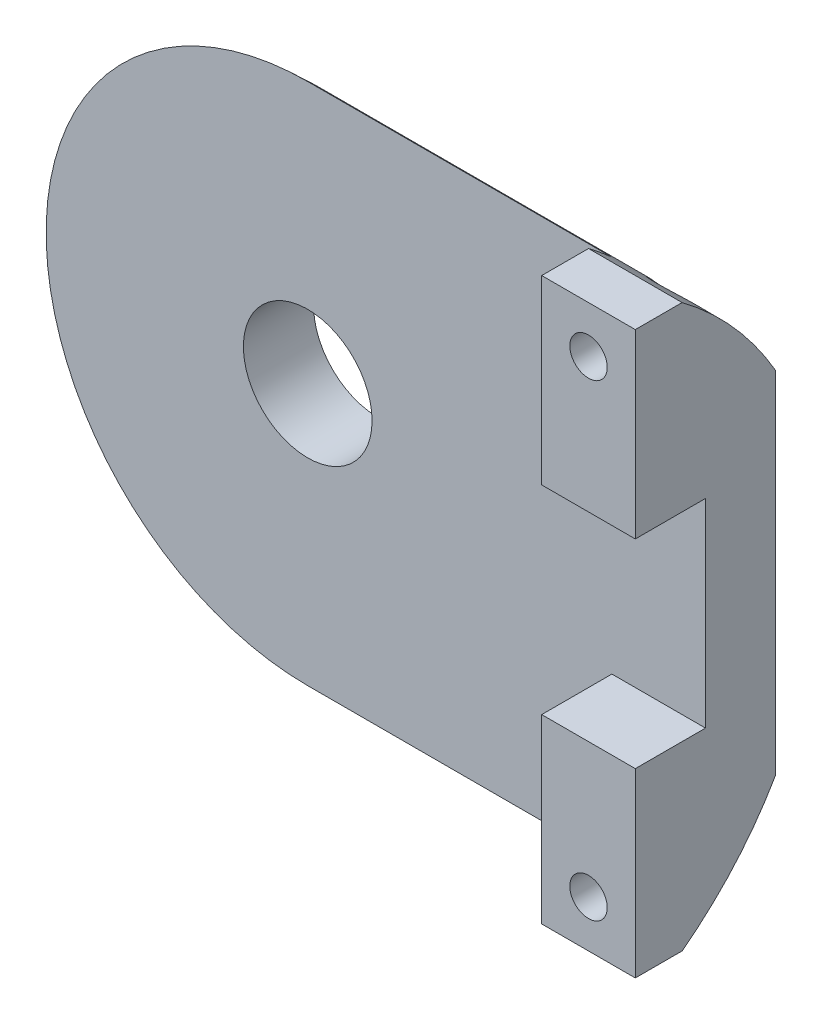
ISO-10303-21;
HEADER;
FILE_DESCRIPTION(('STEP AP214'),'2;1');
FILE_NAME('part.step','',(''),(''),'','','');
FILE_SCHEMA(('AUTOMOTIVE_DESIGN { 1 0 10303 214 1 1 1 1 }'));
ENDSEC;
DATA;
#1=APPLICATION_CONTEXT('core data for automotive mechanical design processes');
#2=APPLICATION_PROTOCOL_DEFINITION('international standard','automotive_design',2000,#1);
#3=PRODUCT_CONTEXT('',#1,'mechanical');
#4=PRODUCT('Part','Part','',(#3));
#5=PRODUCT_RELATED_PRODUCT_CATEGORY('part','',(#4));
#6=PRODUCT_DEFINITION_FORMATION('','',#4);
#7=PRODUCT_DEFINITION_CONTEXT('part definition',#1,'design');
#8=PRODUCT_DEFINITION('design','',#6,#7);
#9=PRODUCT_DEFINITION_SHAPE('','',#8);
#10=(LENGTH_UNIT() NAMED_UNIT(*) SI_UNIT(.MILLI.,.METRE.));
#11=(NAMED_UNIT(*) PLANE_ANGLE_UNIT() SI_UNIT($,.RADIAN.));
#12=(NAMED_UNIT(*) SI_UNIT($,.STERADIAN.) SOLID_ANGLE_UNIT());
#13=UNCERTAINTY_MEASURE_WITH_UNIT(LENGTH_MEASURE(1.E-05),#10,'distance_accuracy_value','');
#14=(GEOMETRIC_REPRESENTATION_CONTEXT(3) GLOBAL_UNCERTAINTY_ASSIGNED_CONTEXT((#13)) GLOBAL_UNIT_ASSIGNED_CONTEXT((#10,
#11,#12)) REPRESENTATION_CONTEXT('',''));
#15=CARTESIAN_POINT('',(0.,0.,0.));
#16=DIRECTION('',(0.,0.,1.));
#17=DIRECTION('',(1.,0.,0.));
#18=AXIS2_PLACEMENT_3D('',#15,#16,#17);
#19=CARTESIAN_POINT('',(17.,0.,13.));
#20=DIRECTION('',(-1.,0.,0.));
#21=DIRECTION('',(0.,0.,1.));
#22=AXIS2_PLACEMENT_3D('',#19,#20,#21);
#23=CYLINDRICAL_SURFACE('',#22,15.);
#24=CARTESIAN_POINT('',(0.,0.,13.));
#25=DIRECTION('',(1.,0.,0.));
#26=DIRECTION('',(0.,0.,-1.));
#27=AXIS2_PLACEMENT_3D('',#24,#25,#26);
#28=CIRCLE('',#27,15.);
#29=CARTESIAN_POINT('',(0.,7.48331477354788,0.));
#30=VERTEX_POINT('',#29);
#31=CARTESIAN_POINT('',(0.,11.1803398874989,3.));
#32=VERTEX_POINT('',#31);
#33=EDGE_CURVE('E174',#30,#32,#28,.T.);
#34=ORIENTED_EDGE('',*,*,#33,.T.);
#35=DIRECTION('',(-1.,0.,0.));
#36=VECTOR('',#35,1.);
#37=CARTESIAN_POINT('',(17.,11.1803398874989,3.));
#38=LINE('',#37,#36);
#39=CARTESIAN_POINT('',(13.,11.1803398874989,3.));
#40=VERTEX_POINT('',#39);
#41=EDGE_CURVE('E81',#32,#40,#38,.F.);
#42=ORIENTED_EDGE('',*,*,#41,.T.);
#43=CARTESIAN_POINT('',(13.,0.,13.));
#44=DIRECTION('',(1.,0.,0.));
#45=DIRECTION('',(0.,0.,-1.));
#46=AXIS2_PLACEMENT_3D('',#43,#44,#45);
#47=CIRCLE('',#46,15.);
#48=CARTESIAN_POINT('',(13.,12.,4.));
#49=VERTEX_POINT('',#48);
#50=EDGE_CURVE('E66',#49,#40,#47,.F.);
#51=ORIENTED_EDGE('',*,*,#50,.F.);
#52=DIRECTION('',(-1.,0.,0.));
#53=VECTOR('',#52,1.);
#54=CARTESIAN_POINT('',(17.,12.,4.));
#55=LINE('',#54,#53);
#56=CARTESIAN_POINT('',(17.,12.,4.));
#57=VERTEX_POINT('',#56);
#58=EDGE_CURVE('E180',#57,#49,#55,.T.);
#59=ORIENTED_EDGE('',*,*,#58,.F.);
#60=CARTESIAN_POINT('',(17.,0.,13.));
#61=DIRECTION('',(1.,0.,0.));
#62=DIRECTION('',(0.,0.,-1.));
#63=AXIS2_PLACEMENT_3D('',#60,#61,#62);
#64=CIRCLE('',#63,15.);
#65=CARTESIAN_POINT('',(17.,7.48331477354788,0.));
#66=VERTEX_POINT('',#65);
#67=EDGE_CURVE('E175',#66,#57,#64,.T.);
#68=ORIENTED_EDGE('',*,*,#67,.F.);
#69=DIRECTION('',(-1.,0.,0.));
#70=VECTOR('',#69,1.);
#71=CARTESIAN_POINT('',(17.,7.48331477354788,0.));
#72=LINE('',#71,#70);
#73=EDGE_CURVE('E183',#30,#66,#72,.F.);
#74=ORIENTED_EDGE('',*,*,#73,.F.);
#75=EDGE_LOOP('',(#34,#42,#51,#59,#68,#74));
#76=FACE_BOUND('',#75,.T.);
#77=CARTESIAN_POINT('',(13.75,10.,1.81966011250105));
#78=CARTESIAN_POINT('',(13.7499998503863,10.0784643323522,1.88984356603473));
#79=CARTESIAN_POINT('',(13.757380461741,10.1562506837837,1.96091485562803));
#80=CARTESIAN_POINT('',(13.7863140743695,10.3091132971139,2.10352320244553));
#81=CARTESIAN_POINT('',(13.8079204516017,10.3841782245068,2.17506100523061));
#82=CARTESIAN_POINT('',(13.871559760487,10.5461357925604,2.33255872131865));
#83=CARTESIAN_POINT('',(13.9170304413381,10.6320173663004,2.41824513065548));
#84=CARTESIAN_POINT('',(14.0015162554637,10.7536276887822,2.54232871556614));
#85=CARTESIAN_POINT('',(14.0323593760308,10.7929330156536,2.5829172704058));
#86=CARTESIAN_POINT('',(14.0997346949454,10.8686708609641,2.66196486606439));
#87=CARTESIAN_POINT('',(14.1362612223841,10.9051061890883,2.70042597834774));
#88=CARTESIAN_POINT('',(14.217628256359,10.9764702490023,2.77649867821142));
#89=CARTESIAN_POINT('',(14.2628308535135,11.0111851148894,2.81392798134915));
#90=CARTESIAN_POINT('',(14.3602096576768,11.0754347817206,2.88382530650904));
#91=CARTESIAN_POINT('',(14.4123744708034,11.1049778676087,2.91630125262463));
#92=CARTESIAN_POINT('',(14.5128330845617,11.1522248081487,2.96860534031294));
#93=CARTESIAN_POINT('',(14.5599181838273,11.1711135058534,2.98966487932261));
#94=CARTESIAN_POINT('',(14.6581055911496,11.2034418615445,3.02585934297017));
#95=CARTESIAN_POINT('',(14.7092050289592,11.2168853712507,3.04099845523126));
#96=CARTESIAN_POINT('',(14.8147935949933,11.2373808786617,3.06412965947108));
#97=CARTESIAN_POINT('',(14.8693092894084,11.244373731003,3.07205560603014));
#98=CARTESIAN_POINT('',(14.9793457523943,11.2510410068866,3.07961157323281));
#99=CARTESIAN_POINT('',(15.0348657103037,11.2507210912068,3.07924801074535));
#100=CARTESIAN_POINT('',(15.1368434314688,11.2433868500477,3.07093810217984));
#101=CARTESIAN_POINT('',(15.183467358204,11.2373307574401,3.06407717425133));
#102=CARTESIAN_POINT('',(15.2746427461308,11.2203378805912,3.04489169751493));
#103=CARTESIAN_POINT('',(15.3191932682158,11.2093989080538,3.03256469906631));
#104=CARTESIAN_POINT('',(15.4189509252489,11.1791869744526,2.99867828614123));
#105=CARTESIAN_POINT('',(15.4731171476014,11.1583761390828,2.97543575342918));
#106=CARTESIAN_POINT('',(15.5756931129646,11.1109843636784,2.92293289942744));
#107=CARTESIAN_POINT('',(15.6240914514995,11.0843922764565,2.89366095827614));
#108=CARTESIAN_POINT('',(15.7337759246856,11.0148197314387,2.81779247872376));
#109=CARTESIAN_POINT('',(15.792137062035,10.9696050992496,2.76903184602933));
#110=CARTESIAN_POINT('',(15.8977285628051,10.8727722273578,2.66617900190982));
#111=CARTESIAN_POINT('',(15.9449376369311,10.8211420223769,2.61207686818228));
#112=CARTESIAN_POINT('',(16.0442254174329,10.6934049778872,2.48038771670546));
#113=CARTESIAN_POINT('',(16.0918195267731,10.6152303857144,2.40142166565994));
#114=CARTESIAN_POINT('',(16.1686249971738,10.4526603176831,2.24105082288588));
#115=CARTESIAN_POINT('',(16.1978200163181,10.3682593857444,2.15964393025025));
#116=CARTESIAN_POINT('',(16.238133622874,10.1939962512464,1.99559363428802));
#117=CARTESIAN_POINT('',(16.2489848367542,10.1040727447775,1.91294936565817));
#118=CARTESIAN_POINT('',(16.2508780926469,9.92210659689489,1.74981398680557));
#119=CARTESIAN_POINT('',(16.2419382813214,9.83006597327913,1.66932097256418));
#120=CARTESIAN_POINT('',(16.2063508743342,9.66378719742494,1.52738593025395));
#121=CARTESIAN_POINT('',(16.183309167634,9.58942433721549,1.46518668912336));
#122=CARTESIAN_POINT('',(16.1220029572906,9.44334454097427,1.34529609004181));
#123=CARTESIAN_POINT('',(16.0837569258375,9.37162450920332,1.28759936323646));
#124=CARTESIAN_POINT('',(16.0007559781238,9.24812189232239,1.18995689457707));
#125=CARTESIAN_POINT('',(15.9589880296179,9.19528574739477,1.14880917233416));
#126=CARTESIAN_POINT('',(15.8651450315651,9.09517086159899,1.07180485855333));
#127=CARTESIAN_POINT('',(15.8130818919344,9.04788579880204,1.03594223587781));
#128=CARTESIAN_POINT('',(15.708495920066,8.96844569101227,0.976313505408047));
#129=CARTESIAN_POINT('',(15.6574763800533,8.93508181305663,0.951527695558451));
#130=CARTESIAN_POINT('',(15.5492314647945,8.87543053413592,0.907518513642392));
#131=CARTESIAN_POINT('',(15.4920082971144,8.84914062741272,0.888293171753172));
#132=CARTESIAN_POINT('',(15.3722718836201,8.80500773974433,0.856170438463259));
#133=CARTESIAN_POINT('',(15.3097291386121,8.78721604201393,0.843311448812086));
#134=CARTESIAN_POINT('',(15.1816107783451,8.76154241646566,0.824794324427773));
#135=CARTESIAN_POINT('',(15.1160368548056,8.75365502860082,0.819132222174195));
#136=CARTESIAN_POINT('',(14.991293877239,8.74864043039217,0.815530616851058));
#137=CARTESIAN_POINT('',(14.9321860014995,8.75045727324141,0.816833273652909));
#138=CARTESIAN_POINT('',(14.8152551828481,8.762332634018,0.825371471355126));
#139=CARTESIAN_POINT('',(14.7574319907894,8.77238953931131,0.832605851378717));
#140=CARTESIAN_POINT('',(14.6459848357639,8.79983573372754,0.852441972105706));
#141=CARTESIAN_POINT('',(14.5922951143918,8.81705224290834,0.864917303059506));
#142=CARTESIAN_POINT('',(14.4888741649897,8.85792085227177,0.894717062566096));
#143=CARTESIAN_POINT('',(14.4391438819997,8.88157448295193,0.912042644348337));
#144=CARTESIAN_POINT('',(14.3406360309057,8.93643507538638,0.952536463078492));
#145=CARTESIAN_POINT('',(14.292262681143,8.9680989824311,0.97606454052665));
#146=CARTESIAN_POINT('',(14.2017166158575,9.03643073579269,1.0273334161003));
#147=CARTESIAN_POINT('',(14.1595459683818,9.07310024320879,1.05507561301972));
#148=CARTESIAN_POINT('',(14.075475376626,9.15632780337148,1.11872013696628));
#149=CARTESIAN_POINT('',(14.0346704552231,9.20353289066879,1.1552192304456));
#150=CARTESIAN_POINT('',(13.9616127739133,9.301435631218,1.2319423115148));
#151=CARTESIAN_POINT('',(13.9293708920646,9.35213762479659,1.27217095028698));
#152=CARTESIAN_POINT('',(13.8595254705056,9.4808834944043,1.37577717524907));
#153=CARTESIAN_POINT('',(13.8269249420074,9.56024551249526,1.44090737451773));
#154=CARTESIAN_POINT('',(13.7787941762193,9.72043601797901,1.5752870287124));
#155=CARTESIAN_POINT('',(13.7632580665817,9.80126399115582,1.64453505792402));
#156=CARTESIAN_POINT('',(13.7518512573405,9.92123991797325,1.74958688600509));
#157=CARTESIAN_POINT('',(13.7500000749267,9.96070497837445,1.78451216385118));
#158=CARTESIAN_POINT('',(13.75,10.,1.81966011250105));
#159=B_SPLINE_CURVE_WITH_KNOTS('',3,(#77,#78,#79,#80,#81,#82,#83,#84,#85,#86,#87,#88,#89,#90,
#91,#92,#93,#94,#95,#96,#97,#98,#99,#100,#101,#102,#103,#104,#105,#106,#107,#108,#109,#110,#111,
#112,#113,#114,#115,#116,#117,#118,#119,#120,#121,#122,#123,#124,#125,#126,#127,#128,#129,#130,
#131,#132,#133,#134,#135,#136,#137,#138,#139,#140,#141,#142,#143,#144,#145,#146,#147,#148,#149,
#150,#151,#152,#153,#154,#155,#156,#157,#158),.UNSPECIFIED.,.T.,.F.,(4,2,2,2,2,2,2,2,2,2,2,2,2,
2,2,2,2,2,2,2,2,2,2,2,2,2,2,2,2,2,2,2,2,2,2,2,2,2,2,2,4),(0.,0.315712342613341,
0.632616060188523,1.01893895799231,1.21178270004569,1.40443524197624,1.60839261905931,
1.81202021527286,1.97618883690521,2.14024112821365,2.30578306539088,2.47119686170746,
2.61309323263217,2.75505325933769,2.9415443247749,3.12839821569723,3.39237032076945,
3.65684234840161,4.01760128580049,4.37868019631128,4.7449780921338,5.11094026352143,
5.40878198386272,5.70626294786083,5.94215437661345,6.17777449594405,6.37438363173882,
6.57092303224354,6.7686339349533,6.96623579569733,7.14280505660041,7.3193397699975,
7.49184102689469,7.66438333377956,7.85091627040536,8.03751125880841,8.25358144396853,
8.4699248150388,8.79135585989899,9.11267625658433,9.27078533568485),.UNSPECIFIED.);
#160=CARTESIAN_POINT('',(13.75,10.,1.81966011250105));
#161=VERTEX_POINT('',#160);
#162=EDGE_CURVE('E57',#161,#161,#159,.T.);
#163=ORIENTED_EDGE('',*,*,#162,.F.);
#164=EDGE_LOOP('',(#163));
#165=FACE_BOUND('',#164,.T.);
#166=ADVANCED_FACE('F53',(#76,#165),#23,.T.);
#167=CARTESIAN_POINT('',(0.,0.,6.));
#168=DIRECTION('',(0.,0.,1.));
#169=DIRECTION('',(1.,0.,0.));
#170=AXIS2_PLACEMENT_3D('',#167,#168,#169);
#171=PLANE('',#170);
#172=DIRECTION('',(0.,-1.,0.));
#173=VECTOR('',#172,1.);
#174=CARTESIAN_POINT('',(13.,0.,6.));
#175=LINE('',#174,#173);
#176=CARTESIAN_POINT('',(13.,-4.25,6.));
#177=VERTEX_POINT('',#176);
#178=CARTESIAN_POINT('',(13.,-12.,6.));
#179=VERTEX_POINT('',#178);
#180=EDGE_CURVE('E187',#177,#179,#175,.T.);
#181=ORIENTED_EDGE('',*,*,#180,.T.);
#182=DIRECTION('',(-1.,0.,0.));
#183=VECTOR('',#182,1.);
#184=CARTESIAN_POINT('',(0.,-12.,6.));
#185=LINE('',#184,#183);
#186=CARTESIAN_POINT('',(17.,-12.,6.));
#187=VERTEX_POINT('',#186);
#188=EDGE_CURVE('E226',#187,#179,#185,.T.);
#189=ORIENTED_EDGE('',*,*,#188,.F.);
#190=DIRECTION('',(0.,-1.,0.));
#191=VECTOR('',#190,1.);
#192=CARTESIAN_POINT('',(17.,0.,6.));
#193=LINE('',#192,#191);
#194=CARTESIAN_POINT('',(17.,-4.25,6.));
#195=VERTEX_POINT('',#194);
#196=EDGE_CURVE('E230',#195,#187,#193,.T.);
#197=ORIENTED_EDGE('',*,*,#196,.F.);
#198=DIRECTION('',(-1.,0.,0.));
#199=VECTOR('',#198,1.);
#200=CARTESIAN_POINT('',(0.,-4.25000000000001,6.));
#201=LINE('',#200,#199);
#202=EDGE_CURVE('E190',#195,#177,#201,.T.);
#203=ORIENTED_EDGE('',*,*,#202,.T.);
#204=EDGE_LOOP('',(#181,#189,#197,#203));
#205=FACE_BOUND('',#204,.T.);
#206=CARTESIAN_POINT('',(15.,-10.,6.));
#207=DIRECTION('',(0.,0.,1.));
#208=DIRECTION('',(1.,0.,0.));
#209=AXIS2_PLACEMENT_3D('',#206,#207,#208);
#210=CIRCLE('',#209,0.800000000000001);
#211=CARTESIAN_POINT('',(15.8,-10.,6.));
#212=VERTEX_POINT('',#211);
#213=EDGE_CURVE('E257',#212,#212,#210,.T.);
#214=ORIENTED_EDGE('',*,*,#213,.F.);
#215=EDGE_LOOP('',(#214));
#216=FACE_BOUND('',#215,.T.);
#217=ADVANCED_FACE('F282',(#205,#216),#171,.T.);
#218=CARTESIAN_POINT('',(17.,0.,13.));
#219=DIRECTION('',(-1.,0.,0.));
#220=DIRECTION('',(0.,0.,1.));
#221=AXIS2_PLACEMENT_3D('',#218,#219,#220);
#222=CYLINDRICAL_SURFACE('',#221,15.);
#223=CARTESIAN_POINT('',(17.,0.,13.));
#224=DIRECTION('',(1.,0.,0.));
#225=DIRECTION('',(0.,0.,-1.));
#226=AXIS2_PLACEMENT_3D('',#223,#224,#225);
#227=CIRCLE('',#226,15.);
#228=CARTESIAN_POINT('',(17.,-12.,4.));
#229=VERTEX_POINT('',#228);
#230=CARTESIAN_POINT('',(17.,-7.48331477354789,0.));
#231=VERTEX_POINT('',#230);
#232=EDGE_CURVE('E156',#229,#231,#227,.T.);
#233=ORIENTED_EDGE('',*,*,#232,.F.);
#234=DIRECTION('',(-1.,0.,0.));
#235=VECTOR('',#234,1.);
#236=CARTESIAN_POINT('',(17.,-12.,4.));
#237=LINE('',#236,#235);
#238=CARTESIAN_POINT('',(13.,-12.,4.));
#239=VERTEX_POINT('',#238);
#240=EDGE_CURVE('E74',#229,#239,#237,.T.);
#241=ORIENTED_EDGE('',*,*,#240,.T.);
#242=CARTESIAN_POINT('',(13.,0.,13.));
#243=DIRECTION('',(1.,0.,0.));
#244=DIRECTION('',(0.,0.,-1.));
#245=AXIS2_PLACEMENT_3D('',#242,#243,#244);
#246=CIRCLE('',#245,15.);
#247=CARTESIAN_POINT('',(13.,-11.180339887499,3.));
#248=VERTEX_POINT('',#247);
#249=EDGE_CURVE('E12',#248,#239,#246,.F.);
#250=ORIENTED_EDGE('',*,*,#249,.F.);
#251=DIRECTION('',(-1.,0.,0.));
#252=VECTOR('',#251,1.);
#253=CARTESIAN_POINT('',(17.,-11.180339887499,3.));
#254=LINE('',#253,#252);
#255=CARTESIAN_POINT('',(0.,-11.180339887499,3.));
#256=VERTEX_POINT('',#255);
#257=EDGE_CURVE('E155',#248,#256,#254,.T.);
#258=ORIENTED_EDGE('',*,*,#257,.T.);
#259=CARTESIAN_POINT('',(0.,0.,13.));
#260=DIRECTION('',(1.,0.,0.));
#261=DIRECTION('',(0.,0.,-1.));
#262=AXIS2_PLACEMENT_3D('',#259,#260,#261);
#263=CIRCLE('',#262,15.);
#264=CARTESIAN_POINT('',(0.,-7.48331477354789,0.));
#265=VERTEX_POINT('',#264);
#266=EDGE_CURVE('E147',#256,#265,#263,.T.);
#267=ORIENTED_EDGE('',*,*,#266,.T.);
#268=DIRECTION('',(-1.,0.,0.));
#269=VECTOR('',#268,1.);
#270=CARTESIAN_POINT('',(17.,-7.48331477354789,0.));
#271=LINE('',#270,#269);
#272=EDGE_CURVE('E169',#231,#265,#271,.T.);
#273=ORIENTED_EDGE('',*,*,#272,.F.);
#274=EDGE_LOOP('',(#233,#241,#250,#258,#267,#273));
#275=FACE_BOUND('',#274,.T.);
#276=CARTESIAN_POINT('',(14.2,-10.,1.81966011250105));
#277=CARTESIAN_POINT('',(14.1999994526656,-9.94962656027075,1.7746054788842));
#278=CARTESIAN_POINT('',(14.2047477058389,-9.8989224224306,1.72987069953345));
#279=CARTESIAN_POINT('',(14.2242352124806,-9.79791865656767,1.64195103730075));
#280=CARTESIAN_POINT('',(14.2389878813333,-9.74761966358109,1.59876831762571));
#281=CARTESIAN_POINT('',(14.2764987491184,-9.65549722463328,1.52069134283831));
#282=CARTESIAN_POINT('',(14.2979421904338,-9.61343181083003,1.48545568188831));
#283=CARTESIAN_POINT('',(14.3493144767505,-9.53211778543202,1.41805257820474));
#284=CARTESIAN_POINT('',(14.3792305275856,-9.49286503767558,1.38588060625202));
#285=CARTESIAN_POINT('',(14.4406941634289,-9.42661140059906,1.33207686591775));
#286=CARTESIAN_POINT('',(14.4706167356666,-9.39875786620244,1.30964288918872));
#287=CARTESIAN_POINT('',(14.5358821357947,-9.34706689944319,1.26827236452168));
#288=CARTESIAN_POINT('',(14.5712190675354,-9.3232251568619,1.24933206089213));
#289=CARTESIAN_POINT('',(14.640855105926,-9.28421617636222,1.21849541232837));
#290=CARTESIAN_POINT('',(14.6744341496764,-9.26827334032899,1.20595875106845));
#291=CARTESIAN_POINT('',(14.7445119317788,-9.24096298086716,1.18454801409117));
#292=CARTESIAN_POINT('',(14.7810093525888,-9.22959340660073,1.17567229661122));
#293=CARTESIAN_POINT('',(14.8561866154484,-9.21208273074457,1.16202474546102));
#294=CARTESIAN_POINT('',(14.8948761847755,-9.20596725773974,1.1572730268013));
#295=CARTESIAN_POINT('',(14.9730210013566,-9.19949555308131,1.15224494427981));
#296=CARTESIAN_POINT('',(15.0124760007165,-9.19913748699481,1.15196715492848));
#297=CARTESIAN_POINT('',(15.0874263386503,-9.20398107481655,1.15572971287073));
#298=CARTESIAN_POINT('',(15.1229724050887,-9.20871118305809,1.15940381666041));
#299=CARTESIAN_POINT('',(15.1925827077845,-9.22271463292072,1.17030800609372));
#300=CARTESIAN_POINT('',(15.2266469097572,-9.2319880795961,1.1775381739632));
#301=CARTESIAN_POINT('',(15.2931983055256,-9.2548161228528,1.19539957966477));
#302=CARTESIAN_POINT('',(15.3256373374012,-9.26845656301824,1.20609907456411));
#303=CARTESIAN_POINT('',(15.3875833128231,-9.29930173073478,1.23040475136419));
#304=CARTESIAN_POINT('',(15.417089322626,-9.31650758801251,1.2440118546031));
#305=CARTESIAN_POINT('',(15.4764626637379,-9.35624572064905,1.2756071275739));
#306=CARTESIAN_POINT('',(15.5058790175283,-9.37917956924716,1.29393479474495));
#307=CARTESIAN_POINT('',(15.5603605214243,-9.42786894408713,1.33311232755544));
#308=CARTESIAN_POINT('',(15.5854223805336,-9.45362658069196,1.35396408080418));
#309=CARTESIAN_POINT('',(15.6423926493898,-9.52032951156979,1.40836684013455));
#310=CARTESIAN_POINT('',(15.6716594099269,-9.56254419289661,1.44314308412787));
#311=CARTESIAN_POINT('',(15.7209515730302,-9.64965209923712,1.51577374450483));
#312=CARTESIAN_POINT('',(15.740958360803,-9.69455051650474,1.55363418284226));
#313=CARTESIAN_POINT('',(15.7759886012761,-9.79652456463219,1.64070444660291));
#314=CARTESIAN_POINT('',(15.7886685886175,-9.85393973996177,1.69045966482881));
#315=CARTESIAN_POINT('',(15.8014782126427,-9.96876627529577,1.79154028501265));
#316=CARTESIAN_POINT('',(15.8015984481308,-10.0261776002763,1.84286683439601));
#317=CARTESIAN_POINT('',(15.7897481103655,-10.1400041876743,1.94620989476781));
#318=CARTESIAN_POINT('',(15.7776730444303,-10.1964065552355,1.99822853520663));
#319=CARTESIAN_POINT('',(15.7413080050076,-10.3062827872247,2.10109271382626));
#320=CARTESIAN_POINT('',(15.7170270547733,-10.3597587826514,2.15193908961084));
#321=CARTESIAN_POINT('',(15.6630742927659,-10.4498841786941,2.23882593850708));
#322=CARTESIAN_POINT('',(15.6360612486925,-10.4875090249383,2.27550986779353));
#323=CARTESIAN_POINT('',(15.5742408596363,-10.5589941154956,2.3458862110084));
#324=CARTESIAN_POINT('',(15.5394460631729,-10.5928602907754,2.37958332054482));
#325=CARTESIAN_POINT('',(15.4722283863742,-10.6467759810881,2.43367582468294));
#326=CARTESIAN_POINT('',(15.4417246829089,-10.6680808240013,2.45519924401481));
#327=CARTESIAN_POINT('',(15.3763380339328,-10.7069731402374,2.49469225189561));
#328=CARTESIAN_POINT('',(15.3414614002407,-10.7245658752926,2.51266686834263));
#329=CARTESIAN_POINT('',(15.2748924204406,-10.751973591176,2.54077567922466));
#330=CARTESIAN_POINT('',(15.2439103846536,-10.7626367108779,2.55175566976894));
#331=CARTESIAN_POINT('',(15.1798314754488,-10.7802316698172,2.56991053819876));
#332=CARTESIAN_POINT('',(15.1467362313157,-10.7871663457361,2.57708830883483));
#333=CARTESIAN_POINT('',(15.0790726673294,-10.7968192495087,2.58708759297895));
#334=CARTESIAN_POINT('',(15.0444968939338,-10.7995126977748,2.58988350481162));
#335=CARTESIAN_POINT('',(14.9752309237216,-10.8003656768294,2.59076841986352));
#336=CARTESIAN_POINT('',(14.9405407507373,-10.7985260988922,2.58885834836342));
#337=CARTESIAN_POINT('',(14.8753880288784,-10.7908534236001,2.58090659194521));
#338=CARTESIAN_POINT('',(14.8448295002884,-10.7854019755555,2.57525981145001));
#339=CARTESIAN_POINT('',(14.7853073939934,-10.771261534697,2.56065002613261));
#340=CARTESIAN_POINT('',(14.7563444730935,-10.7625712199198,2.55168566723085));
#341=CARTESIAN_POINT('',(14.6908396507782,-10.7389276792463,2.52737821088086));
#342=CARTESIAN_POINT('',(14.6551255288173,-10.7228482179246,2.51090150740965));
#343=CARTESIAN_POINT('',(14.5879010460791,-10.68675855592,2.47413387687676));
#344=CARTESIAN_POINT('',(14.5563986981192,-10.6667410369835,2.4538358515668));
#345=CARTESIAN_POINT('',(14.4866604328663,-10.6156202306072,2.40234180607898));
#346=CARTESIAN_POINT('',(14.4503252782965,-10.5831737757234,2.36991238155233));
#347=CARTESIAN_POINT('',(14.3853660867243,-10.5142711801878,2.30175396535893));
#348=CARTESIAN_POINT('',(14.3567587449438,-10.4778065941007,2.26601805027237));
#349=CARTESIAN_POINT('',(14.2989592473904,-10.3900138949004,2.18092327209214));
#350=CARTESIAN_POINT('',(14.2724456877726,-10.3376332905402,2.13083148067057));
#351=CARTESIAN_POINT('',(14.2315546474788,-10.2298039473103,2.02928469500246));
#352=CARTESIAN_POINT('',(14.2171585141728,-10.1743600645455,1.97783192215274));
#353=CARTESIAN_POINT('',(14.2029397838767,-10.0790516256717,1.89074587591139));
#354=CARTESIAN_POINT('',(14.200000430581,-10.039628143539,1.85510401900537));
#355=CARTESIAN_POINT('',(14.2,-10.,1.81966011250105));
#356=B_SPLINE_CURVE_WITH_KNOTS('',3,(#276,#277,#278,#279,#280,#281,#282,#283,#284,#285,#286,
#287,#288,#289,#290,#291,#292,#293,#294,#295,#296,#297,#298,#299,#300,#301,#302,#303,#304,#305,
#306,#307,#308,#309,#310,#311,#312,#313,#314,#315,#316,#317,#318,#319,#320,#321,#322,#323,#324,
#325,#326,#327,#328,#329,#330,#331,#332,#333,#334,#335,#336,#337,#338,#339,#340,#341,#342,#343,
#344,#345,#346,#347,#348,#349,#350,#351,#352,#353,#354,#355),.UNSPECIFIED.,.T.,.F.,(4,2,2,2,2,2,
2,2,2,2,2,2,2,2,2,2,2,2,2,2,2,2,2,2,2,2,2,2,2,2,2,2,2,2,2,2,2,2,2,4),(0.,0.202624862732401,
0.405521973207397,0.581620006639299,0.7574535261309,0.896821667908282,1.03603910477935,
1.15323425169383,1.27037678475669,1.38808752606323,1.505760761468,1.6133984628665,
1.72103865325793,1.83094009049886,1.94087640415005,2.06509387355148,2.18940481824664,
2.37448125837898,2.55992814824211,2.7898196354212,3.01988319920104,3.2519348758987,
3.48381525910179,3.66050301483012,3.83690787992481,3.96543645201778,4.09378159873824,
4.19703717401642,4.30021407862696,4.40399159205188,4.50774870258573,4.6019918905041,
4.6962735865605,4.82304607696243,4.9500564179807,5.12466429721688,5.29964643726226,
5.52999072953048,5.75997979575094,5.91938219487403),.UNSPECIFIED.);
#357=CARTESIAN_POINT('',(14.2,-10.,1.81966011250105));
#358=VERTEX_POINT('',#357);
#359=EDGE_CURVE('E251',#358,#358,#356,.T.);
#360=ORIENTED_EDGE('',*,*,#359,.F.);
#361=EDGE_LOOP('',(#360));
#362=FACE_BOUND('',#361,.T.);
#363=ADVANCED_FACE('F166',(#275,#362),#222,.T.);
#364=DIRECTION('',(1.,0.,0.));
#365=VECTOR('',#364,1.);
#366=CARTESIAN_POINT('',(0.,4.24999999999999,6.));
#367=LINE('',#366,#365);
#368=CARTESIAN_POINT('',(13.,4.25,6.));
#369=VERTEX_POINT('',#368);
#370=CARTESIAN_POINT('',(17.,4.25,6.));
#371=VERTEX_POINT('',#370);
#372=EDGE_CURVE('E194',#369,#371,#367,.T.);
#373=ORIENTED_EDGE('',*,*,#372,.T.);
#374=CARTESIAN_POINT('',(17.,12.,6.));
#375=VERTEX_POINT('',#374);
#376=EDGE_CURVE('E231',#375,#371,#193,.T.);
#377=ORIENTED_EDGE('',*,*,#376,.F.);
#378=DIRECTION('',(-1.,0.,0.));
#379=VECTOR('',#378,1.);
#380=CARTESIAN_POINT('',(0.,12.,6.));
#381=LINE('',#380,#379);
#382=CARTESIAN_POINT('',(13.,12.,6.));
#383=VERTEX_POINT('',#382);
#384=EDGE_CURVE('E223',#375,#383,#381,.T.);
#385=ORIENTED_EDGE('',*,*,#384,.T.);
#386=DIRECTION('',(0.,1.,0.));
#387=VECTOR('',#386,1.);
#388=CARTESIAN_POINT('',(13.,0.,6.));
#389=LINE('',#388,#387);
#390=EDGE_CURVE('E245',#369,#383,#389,.T.);
#391=ORIENTED_EDGE('',*,*,#390,.F.);
#392=EDGE_LOOP('',(#373,#377,#385,#391));
#393=FACE_BOUND('',#392,.T.);
#394=CARTESIAN_POINT('',(15.,10.,6.));
#395=DIRECTION('',(0.,0.,1.));
#396=DIRECTION('',(1.,0.,0.));
#397=AXIS2_PLACEMENT_3D('',#394,#395,#396);
#398=CIRCLE('',#397,0.800000000000001);
#399=CARTESIAN_POINT('',(15.8,10.,6.));
#400=VERTEX_POINT('',#399);
#401=EDGE_CURVE('E164',#400,#400,#398,.T.);
#402=ORIENTED_EDGE('',*,*,#401,.F.);
#403=EDGE_LOOP('',(#402));
#404=FACE_BOUND('',#403,.T.);
#405=ADVANCED_FACE('F289',(#393,#404),#171,.T.);
#406=CARTESIAN_POINT('',(0.,0.,0.));
#407=DIRECTION('',(0.,0.,1.));
#408=DIRECTION('',(1.,0.,0.));
#409=AXIS2_PLACEMENT_3D('',#406,#407,#408);
#410=PLANE('',#409);
#411=CARTESIAN_POINT('',(0.,0.,0.));
#412=DIRECTION('',(0.,0.,1.));
#413=DIRECTION('',(1.,0.,0.));
#414=AXIS2_PLACEMENT_3D('',#411,#412,#413);
#415=CIRCLE('',#414,2.75);
#416=CARTESIAN_POINT('',(2.75,0.,0.));
#417=VERTEX_POINT('',#416);
#418=EDGE_CURVE('E227',#417,#417,#415,.T.);
#419=ORIENTED_EDGE('',*,*,#418,.T.);
#420=EDGE_LOOP('',(#419));
#421=FACE_BOUND('',#420,.T.);
#422=CARTESIAN_POINT('',(0.,0.,0.));
#423=DIRECTION('',(0.,0.,1.));
#424=DIRECTION('',(1.,0.,0.));
#425=AXIS2_PLACEMENT_3D('',#422,#423,#424);
#426=CIRCLE('',#425,7.48331477354788);
#427=EDGE_CURVE('E152',#30,#265,#426,.T.);
#428=ORIENTED_EDGE('',*,*,#427,.F.);
#429=ORIENTED_EDGE('',*,*,#73,.T.);
#430=DIRECTION('',(0.,-1.,0.));
#431=VECTOR('',#430,1.);
#432=CARTESIAN_POINT('',(17.,0.,0.));
#433=LINE('',#432,#431);
#434=EDGE_CURVE('E235',#66,#231,#433,.T.);
#435=ORIENTED_EDGE('',*,*,#434,.T.);
#436=ORIENTED_EDGE('',*,*,#272,.T.);
#437=EDGE_LOOP('',(#428,#429,#435,#436));
#438=FACE_BOUND('',#437,.T.);
#439=ADVANCED_FACE('F296',(#421,#438),#410,.F.);
#440=CARTESIAN_POINT('',(0.,0.,3.));
#441=DIRECTION('',(0.,0.,1.));
#442=DIRECTION('',(1.,0.,0.));
#443=AXIS2_PLACEMENT_3D('',#440,#441,#442);
#444=PLANE('',#443);
#445=CARTESIAN_POINT('',(0.,0.,3.));
#446=DIRECTION('',(0.,0.,1.));
#447=DIRECTION('',(1.,0.,0.));
#448=AXIS2_PLACEMENT_3D('',#445,#446,#447);
#449=CIRCLE('',#448,2.75);
#450=CARTESIAN_POINT('',(2.75,0.,3.));
#451=VERTEX_POINT('',#450);
#452=EDGE_CURVE('E222',#451,#451,#449,.T.);
#453=ORIENTED_EDGE('',*,*,#452,.F.);
#454=EDGE_LOOP('',(#453));
#455=FACE_BOUND('',#454,.T.);
#456=ORIENTED_EDGE('',*,*,#41,.F.);
#457=CARTESIAN_POINT('',(0.,0.,3.));
#458=DIRECTION('',(0.,0.,1.));
#459=DIRECTION('',(1.,0.,0.));
#460=AXIS2_PLACEMENT_3D('',#457,#458,#459);
#461=CIRCLE('',#460,11.180339887499);
#462=EDGE_CURVE('E150',#32,#256,#461,.T.);
#463=ORIENTED_EDGE('',*,*,#462,.T.);
#464=ORIENTED_EDGE('',*,*,#257,.F.);
#465=DIRECTION('',(0.,-1.,0.));
#466=VECTOR('',#465,1.);
#467=CARTESIAN_POINT('',(13.,0.,3.));
#468=LINE('',#467,#466);
#469=CARTESIAN_POINT('',(13.,-4.25,3.));
#470=VERTEX_POINT('',#469);
#471=EDGE_CURVE('E186',#470,#248,#468,.T.);
#472=ORIENTED_EDGE('',*,*,#471,.F.);
#473=DIRECTION('',(-1.,0.,0.));
#474=VECTOR('',#473,1.);
#475=CARTESIAN_POINT('',(0.,-4.25000000000001,3.));
#476=LINE('',#475,#474);
#477=CARTESIAN_POINT('',(17.,-4.25,3.));
#478=VERTEX_POINT('',#477);
#479=EDGE_CURVE('E199',#478,#470,#476,.T.);
#480=ORIENTED_EDGE('',*,*,#479,.F.);
#481=DIRECTION('',(0.,-1.,0.));
#482=VECTOR('',#481,1.);
#483=CARTESIAN_POINT('',(17.,0.,3.));
#484=LINE('',#483,#482);
#485=CARTESIAN_POINT('',(17.,4.25,3.));
#486=VERTEX_POINT('',#485);
#487=EDGE_CURVE('E202',#486,#478,#484,.T.);
#488=ORIENTED_EDGE('',*,*,#487,.F.);
#489=DIRECTION('',(1.,0.,0.));
#490=VECTOR('',#489,1.);
#491=CARTESIAN_POINT('',(0.,4.24999999999999,3.));
#492=LINE('',#491,#490);
#493=CARTESIAN_POINT('',(13.,4.25,3.));
#494=VERTEX_POINT('',#493);
#495=EDGE_CURVE('E205',#494,#486,#492,.T.);
#496=ORIENTED_EDGE('',*,*,#495,.F.);
#497=DIRECTION('',(0.,-1.,0.));
#498=VECTOR('',#497,1.);
#499=CARTESIAN_POINT('',(13.,0.,3.));
#500=LINE('',#499,#498);
#501=EDGE_CURVE('E191',#40,#494,#500,.T.);
#502=ORIENTED_EDGE('',*,*,#501,.F.);
#503=EDGE_LOOP('',(#456,#463,#464,#472,#480,#488,#496,#502));
#504=FACE_BOUND('',#503,.T.);
#505=ADVANCED_FACE('F160',(#455,#504),#444,.T.);
#506=CARTESIAN_POINT('',(0.,0.,6.));
#507=DIRECTION('',(0.,0.,-1.));
#508=DIRECTION('',(-1.,0.,0.));
#509=AXIS2_PLACEMENT_3D('',#506,#507,#508);
#510=CYLINDRICAL_SURFACE('',#509,2.75);
#511=ORIENTED_EDGE('',*,*,#418,.F.);
#512=EDGE_LOOP('',(#511));
#513=FACE_BOUND('',#512,.T.);
#514=ORIENTED_EDGE('',*,*,#452,.T.);
#515=EDGE_LOOP('',(#514));
#516=FACE_BOUND('',#515,.T.);
#517=ADVANCED_FACE('F295',(#513,#516),#510,.F.);
#518=CARTESIAN_POINT('',(0.,12.,6.));
#519=DIRECTION('',(0.,-1.,0.));
#520=DIRECTION('',(0.,0.,-1.));
#521=AXIS2_PLACEMENT_3D('',#518,#519,#520);
#522=PLANE('',#521);
#523=DIRECTION('',(0.,0.,-1.));
#524=VECTOR('',#523,1.);
#525=CARTESIAN_POINT('',(17.,12.,6.));
#526=LINE('',#525,#524);
#527=EDGE_CURVE('E234',#375,#57,#526,.T.);
#528=ORIENTED_EDGE('',*,*,#527,.T.);
#529=ORIENTED_EDGE('',*,*,#58,.T.);
#530=DIRECTION('',(0.,0.,1.));
#531=VECTOR('',#530,1.);
#532=CARTESIAN_POINT('',(13.,12.,6.));
#533=LINE('',#532,#531);
#534=EDGE_CURVE('E218',#49,#383,#533,.T.);
#535=ORIENTED_EDGE('',*,*,#534,.T.);
#536=ORIENTED_EDGE('',*,*,#384,.F.);
#537=EDGE_LOOP('',(#528,#529,#535,#536));
#538=FACE_BOUND('',#537,.T.);
#539=ADVANCED_FACE('F55',(#538),#522,.F.);
#540=CARTESIAN_POINT('',(0.,-12.,6.));
#541=DIRECTION('',(0.,-1.,0.));
#542=DIRECTION('',(0.,0.,-1.));
#543=AXIS2_PLACEMENT_3D('',#540,#541,#542);
#544=PLANE('',#543);
#545=ORIENTED_EDGE('',*,*,#240,.F.);
#546=DIRECTION('',(0.,0.,-1.));
#547=VECTOR('',#546,1.);
#548=CARTESIAN_POINT('',(17.,-12.,6.));
#549=LINE('',#548,#547);
#550=EDGE_CURVE('E242',#187,#229,#549,.T.);
#551=ORIENTED_EDGE('',*,*,#550,.F.);
#552=ORIENTED_EDGE('',*,*,#188,.T.);
#553=DIRECTION('',(0.,0.,1.));
#554=VECTOR('',#553,1.);
#555=CARTESIAN_POINT('',(13.,-12.,6.));
#556=LINE('',#555,#554);
#557=EDGE_CURVE('E220',#239,#179,#556,.T.);
#558=ORIENTED_EDGE('',*,*,#557,.F.);
#559=EDGE_LOOP('',(#545,#551,#552,#558));
#560=FACE_BOUND('',#559,.T.);
#561=ADVANCED_FACE('F319',(#560),#544,.T.);
#562=CARTESIAN_POINT('',(17.,0.,6.));
#563=DIRECTION('',(1.,0.,0.));
#564=DIRECTION('',(0.,0.,-1.));
#565=AXIS2_PLACEMENT_3D('',#562,#563,#564);
#566=PLANE('',#565);
#567=ORIENTED_EDGE('',*,*,#232,.T.);
#568=ORIENTED_EDGE('',*,*,#434,.F.);
#569=ORIENTED_EDGE('',*,*,#67,.T.);
#570=ORIENTED_EDGE('',*,*,#527,.F.);
#571=ORIENTED_EDGE('',*,*,#376,.T.);
#572=DIRECTION('',(0.,0.,-1.));
#573=VECTOR('',#572,1.);
#574=CARTESIAN_POINT('',(17.,4.25,6.));
#575=LINE('',#574,#573);
#576=EDGE_CURVE('E211',#371,#486,#575,.T.);
#577=ORIENTED_EDGE('',*,*,#576,.T.);
#578=ORIENTED_EDGE('',*,*,#487,.T.);
#579=DIRECTION('',(0.,0.,-1.));
#580=VECTOR('',#579,1.);
#581=CARTESIAN_POINT('',(17.,-4.25,6.));
#582=LINE('',#581,#580);
#583=EDGE_CURVE('E214',#195,#478,#582,.T.);
#584=ORIENTED_EDGE('',*,*,#583,.F.);
#585=ORIENTED_EDGE('',*,*,#196,.T.);
#586=ORIENTED_EDGE('',*,*,#550,.T.);
#587=EDGE_LOOP('',(#567,#568,#569,#570,#571,#577,#578,#584,#585,#586));
#588=FACE_BOUND('',#587,.T.);
#589=ADVANCED_FACE('F301',(#588),#566,.T.);
#590=CARTESIAN_POINT('',(13.,0.,6.));
#591=DIRECTION('',(1.,0.,0.));
#592=DIRECTION('',(0.,0.,-1.));
#593=AXIS2_PLACEMENT_3D('',#590,#591,#592);
#594=PLANE('',#593);
#595=ORIENTED_EDGE('',*,*,#534,.F.);
#596=ORIENTED_EDGE('',*,*,#50,.T.);
#597=ORIENTED_EDGE('',*,*,#501,.T.);
#598=DIRECTION('',(0.,0.,-1.));
#599=VECTOR('',#598,1.);
#600=CARTESIAN_POINT('',(13.,4.25,6.));
#601=LINE('',#600,#599);
#602=EDGE_CURVE('E197',#369,#494,#601,.T.);
#603=ORIENTED_EDGE('',*,*,#602,.F.);
#604=ORIENTED_EDGE('',*,*,#390,.T.);
#605=EDGE_LOOP('',(#595,#596,#597,#603,#604));
#606=FACE_BOUND('',#605,.T.);
#607=ADVANCED_FACE('F298',(#606),#594,.F.);
#608=CARTESIAN_POINT('',(13.,0.,6.));
#609=DIRECTION('',(1.,0.,0.));
#610=DIRECTION('',(0.,0.,-1.));
#611=AXIS2_PLACEMENT_3D('',#608,#609,#610);
#612=PLANE('',#611);
#613=ORIENTED_EDGE('',*,*,#471,.T.);
#614=ORIENTED_EDGE('',*,*,#249,.T.);
#615=ORIENTED_EDGE('',*,*,#557,.T.);
#616=ORIENTED_EDGE('',*,*,#180,.F.);
#617=DIRECTION('',(0.,0.,-1.));
#618=VECTOR('',#617,1.);
#619=CARTESIAN_POINT('',(13.,-4.25,6.));
#620=LINE('',#619,#618);
#621=EDGE_CURVE('E216',#177,#470,#620,.T.);
#622=ORIENTED_EDGE('',*,*,#621,.T.);
#623=EDGE_LOOP('',(#613,#614,#615,#616,#622));
#624=FACE_BOUND('',#623,.T.);
#625=ADVANCED_FACE('F300',(#624),#612,.F.);
#626=CARTESIAN_POINT('',(0.,-4.25000000000001,6.));
#627=DIRECTION('',(0.,-1.,0.));
#628=DIRECTION('',(1.,0.,0.));
#629=AXIS2_PLACEMENT_3D('',#626,#627,#628);
#630=PLANE('',#629);
#631=ORIENTED_EDGE('',*,*,#479,.T.);
#632=ORIENTED_EDGE('',*,*,#621,.F.);
#633=ORIENTED_EDGE('',*,*,#202,.F.);
#634=ORIENTED_EDGE('',*,*,#583,.T.);
#635=EDGE_LOOP('',(#631,#632,#633,#634));
#636=FACE_BOUND('',#635,.T.);
#637=ADVANCED_FACE('F278',(#636),#630,.F.);
#638=CARTESIAN_POINT('',(0.,4.24999999999999,6.));
#639=DIRECTION('',(0.,1.,0.));
#640=DIRECTION('',(-1.,0.,0.));
#641=AXIS2_PLACEMENT_3D('',#638,#639,#640);
#642=PLANE('',#641);
#643=ORIENTED_EDGE('',*,*,#495,.T.);
#644=ORIENTED_EDGE('',*,*,#576,.F.);
#645=ORIENTED_EDGE('',*,*,#372,.F.);
#646=ORIENTED_EDGE('',*,*,#602,.T.);
#647=EDGE_LOOP('',(#643,#644,#645,#646));
#648=FACE_BOUND('',#647,.T.);
#649=ADVANCED_FACE('F273',(#648),#642,.F.);
#650=CARTESIAN_POINT('',(0.,0.,13.));
#651=DIRECTION('',(0.,0.,-1.));
#652=DIRECTION('',(0.,-1.,0.));
#653=AXIS2_PLACEMENT_3D('',#650,#651,#652);
#654=SPHERICAL_SURFACE('',#653,15.);
#655=ORIENTED_EDGE('',*,*,#427,.T.);
#656=ORIENTED_EDGE('',*,*,#266,.F.);
#657=ORIENTED_EDGE('',*,*,#462,.F.);
#658=ORIENTED_EDGE('',*,*,#33,.F.);
#659=EDGE_LOOP('',(#655,#656,#657,#658));
#660=FACE_BOUND('',#659,.T.);
#661=ADVANCED_FACE('F149',(#660),#654,.T.);
#662=CARTESIAN_POINT('',(15.,10.,6.));
#663=DIRECTION('',(0.,0.,-1.));
#664=DIRECTION('',(-1.,0.,0.));
#665=AXIS2_PLACEMENT_3D('',#662,#663,#664);
#666=CYLINDRICAL_SURFACE('',#665,0.800000000000001);
#667=CARTESIAN_POINT('',(15.,10.,4.));
#668=DIRECTION('',(0.,0.,1.));
#669=DIRECTION('',(1.,0.,0.));
#670=AXIS2_PLACEMENT_3D('',#667,#668,#669);
#671=CIRCLE('',#670,0.800000000000001);
#672=CARTESIAN_POINT('',(15.8,10.,4.));
#673=VERTEX_POINT('',#672);
#674=EDGE_CURVE('E258',#673,#673,#671,.T.);
#675=ORIENTED_EDGE('',*,*,#674,.F.);
#676=EDGE_LOOP('',(#675));
#677=FACE_BOUND('',#676,.T.);
#678=ORIENTED_EDGE('',*,*,#401,.T.);
#679=EDGE_LOOP('',(#678));
#680=FACE_BOUND('',#679,.T.);
#681=ADVANCED_FACE('F266',(#677,#680),#666,.F.);
#682=CARTESIAN_POINT('',(15.,-10.,6.));
#683=DIRECTION('',(0.,0.,-1.));
#684=DIRECTION('',(-1.,0.,0.));
#685=AXIS2_PLACEMENT_3D('',#682,#683,#684);
#686=CYLINDRICAL_SURFACE('',#685,0.800000000000001);
#687=ORIENTED_EDGE('',*,*,#213,.T.);
#688=EDGE_LOOP('',(#687));
#689=FACE_BOUND('',#688,.T.);
#690=ORIENTED_EDGE('',*,*,#359,.T.);
#691=EDGE_LOOP('',(#690));
#692=FACE_BOUND('',#691,.T.);
#693=ADVANCED_FACE('F261',(#689,#692),#686,.F.);
#694=CARTESIAN_POINT('',(15.,10.,4.));
#695=DIRECTION('',(0.,0.,-1.));
#696=DIRECTION('',(-1.,0.,0.));
#697=AXIS2_PLACEMENT_3D('',#694,#695,#696);
#698=CYLINDRICAL_SURFACE('',#697,1.25);
#699=CARTESIAN_POINT('',(15.,10.,4.));
#700=DIRECTION('',(0.,0.,1.));
#701=DIRECTION('',(1.,0.,0.));
#702=AXIS2_PLACEMENT_3D('',#699,#700,#701);
#703=CIRCLE('',#702,1.25);
#704=CARTESIAN_POINT('',(16.25,10.,4.));
#705=VERTEX_POINT('',#704);
#706=EDGE_CURVE('E352',#705,#705,#703,.T.);
#707=ORIENTED_EDGE('',*,*,#706,.T.);
#708=EDGE_LOOP('',(#707));
#709=FACE_BOUND('',#708,.T.);
#710=ORIENTED_EDGE('',*,*,#162,.T.);
#711=EDGE_LOOP('',(#710));
#712=FACE_BOUND('',#711,.T.);
#713=ADVANCED_FACE('F265',(#709,#712),#698,.F.);
#714=CARTESIAN_POINT('',(15.,10.,4.));
#715=DIRECTION('',(0.,0.,1.));
#716=DIRECTION('',(1.,0.,0.));
#717=AXIS2_PLACEMENT_3D('',#714,#715,#716);
#718=PLANE('',#717);
#719=ORIENTED_EDGE('',*,*,#674,.T.);
#720=EDGE_LOOP('',(#719));
#721=FACE_BOUND('',#720,.T.);
#722=ORIENTED_EDGE('',*,*,#706,.F.);
#723=EDGE_LOOP('',(#722));
#724=FACE_BOUND('',#723,.T.);
#725=ADVANCED_FACE('F363',(#721,#724),#718,.F.);
#726=CLOSED_SHELL('',(#166,#217,#363,#405,#439,#505,#517,#539,#561,#589,#607,#625,#637,#649,
#661,#681,#693,#713,#725));
#727=MANIFOLD_SOLID_BREP('B2',#726);
#728=ADVANCED_BREP_SHAPE_REPRESENTATION('',(#18,#727),#14);
#729=SHAPE_DEFINITION_REPRESENTATION(#9,#728);
ENDSEC;
END-ISO-10303-21;
